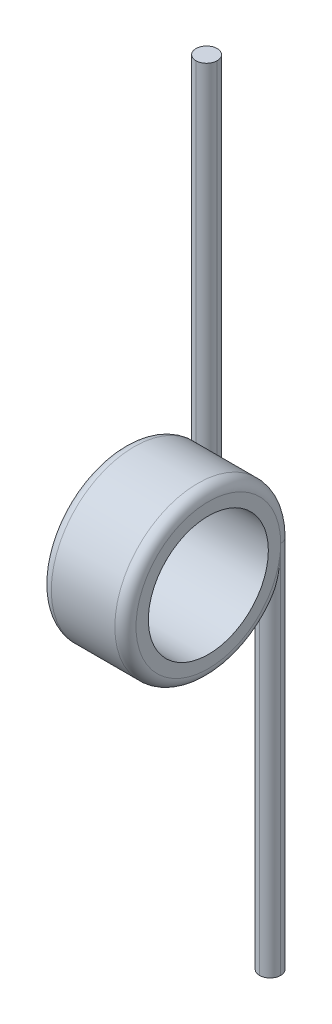
ISO-10303-21;
HEADER;
FILE_DESCRIPTION(('STEP AP214'),'2;1');
FILE_NAME('part.step','',(''),(''),'','','');
FILE_SCHEMA(('AUTOMOTIVE_DESIGN { 1 0 10303 214 1 1 1 1 }'));
ENDSEC;
DATA;
#1=APPLICATION_CONTEXT('core data for automotive mechanical design processes');
#2=APPLICATION_PROTOCOL_DEFINITION('international standard','automotive_design',2000,#1);
#3=PRODUCT_CONTEXT('',#1,'mechanical');
#4=PRODUCT('Part','Part','',(#3));
#5=PRODUCT_RELATED_PRODUCT_CATEGORY('part','',(#4));
#6=PRODUCT_DEFINITION_FORMATION('','',#4);
#7=PRODUCT_DEFINITION_CONTEXT('part definition',#1,'design');
#8=PRODUCT_DEFINITION('design','',#6,#7);
#9=PRODUCT_DEFINITION_SHAPE('','',#8);
#10=(LENGTH_UNIT() NAMED_UNIT(*) SI_UNIT(.MILLI.,.METRE.));
#11=(NAMED_UNIT(*) PLANE_ANGLE_UNIT() SI_UNIT($,.RADIAN.));
#12=(NAMED_UNIT(*) SI_UNIT($,.STERADIAN.) SOLID_ANGLE_UNIT());
#13=UNCERTAINTY_MEASURE_WITH_UNIT(LENGTH_MEASURE(1.E-05),#10,'distance_accuracy_value','');
#14=(GEOMETRIC_REPRESENTATION_CONTEXT(3) GLOBAL_UNCERTAINTY_ASSIGNED_CONTEXT((#13)) GLOBAL_UNIT_ASSIGNED_CONTEXT((#10,
#11,#12)) REPRESENTATION_CONTEXT('',''));
#15=CARTESIAN_POINT('',(0.,0.,0.));
#16=DIRECTION('',(0.,0.,1.));
#17=DIRECTION('',(1.,0.,0.));
#18=AXIS2_PLACEMENT_3D('',#15,#16,#17);
#19=CARTESIAN_POINT('',(2.4,-10.6015024974155,0.));
#20=DIRECTION('',(0.,1.,0.));
#21=DIRECTION('',(0.,0.,1.));
#22=AXIS2_PLACEMENT_3D('',#19,#20,#21);
#23=PLANE('',#22);
#24=CARTESIAN_POINT('',(2.1,-10.6015024974155,-2.05));
#25=DIRECTION('',(0.,1.,0.));
#26=DIRECTION('',(0.,0.,1.));
#27=AXIS2_PLACEMENT_3D('',#24,#25,#26);
#28=CIRCLE('',#27,0.3);
#29=CARTESIAN_POINT('',(1.8,-10.6015024974155,-2.05));
#30=VERTEX_POINT('',#29);
#31=CARTESIAN_POINT('',(2.1,-10.6015024974155,-2.35));
#32=VERTEX_POINT('',#31);
#33=EDGE_CURVE('E126',#30,#32,#28,.F.);
#34=ORIENTED_EDGE('',*,*,#33,.T.);
#35=CARTESIAN_POINT('',(2.1,-10.6015024974155,-2.05));
#36=DIRECTION('',(0.,1.,0.));
#37=DIRECTION('',(0.,0.,1.));
#38=AXIS2_PLACEMENT_3D('',#35,#36,#37);
#39=CIRCLE('',#38,0.3);
#40=CARTESIAN_POINT('',(2.4,-10.6015024974155,-2.05));
#41=VERTEX_POINT('',#40);
#42=EDGE_CURVE('E121',#32,#41,#39,.F.);
#43=ORIENTED_EDGE('',*,*,#42,.T.);
#44=CARTESIAN_POINT('',(2.1,-10.6015024974155,-2.05));
#45=DIRECTION('',(0.,1.,0.));
#46=DIRECTION('',(0.,0.,1.));
#47=AXIS2_PLACEMENT_3D('',#44,#45,#46);
#48=CIRCLE('',#47,0.3);
#49=CARTESIAN_POINT('',(2.1,-10.6015024974155,-1.75));
#50=VERTEX_POINT('',#49);
#51=EDGE_CURVE('E102',#41,#50,#48,.F.);
#52=ORIENTED_EDGE('',*,*,#51,.T.);
#53=CARTESIAN_POINT('',(2.1,-10.6015024974155,-2.05));
#54=DIRECTION('',(0.,1.,0.));
#55=DIRECTION('',(0.,0.,1.));
#56=AXIS2_PLACEMENT_3D('',#53,#54,#55);
#57=CIRCLE('',#56,0.3);
#58=EDGE_CURVE('E113',#50,#30,#57,.F.);
#59=ORIENTED_EDGE('',*,*,#58,.T.);
#60=EDGE_LOOP('',(#34,#43,#52,#59));
#61=FACE_BOUND('',#60,.T.);
#62=ADVANCED_FACE('F34',(#61),#23,.F.);
#63=CARTESIAN_POINT('',(0.,0.,0.));
#64=DIRECTION('',(1.,0.,0.));
#65=DIRECTION('',(0.,0.,-1.));
#66=AXIS2_PLACEMENT_3D('',#63,#64,#65);
#67=PLANE('',#66);
#68=CARTESIAN_POINT('',(0.,0.,0.));
#69=DIRECTION('',(1.,0.,0.));
#70=DIRECTION('',(0.,0.,-1.));
#71=AXIS2_PLACEMENT_3D('',#68,#69,#70);
#72=CIRCLE('',#71,2.05);
#73=CARTESIAN_POINT('',(0.,0.,-2.05));
#74=VERTEX_POINT('',#73);
#75=EDGE_CURVE('E114',#74,#74,#72,.F.);
#76=ORIENTED_EDGE('',*,*,#75,.T.);
#77=EDGE_LOOP('',(#76));
#78=FACE_BOUND('',#77,.T.);
#79=CARTESIAN_POINT('',(0.,0.,0.));
#80=DIRECTION('',(1.,0.,0.));
#81=DIRECTION('',(0.,0.,-1.));
#82=AXIS2_PLACEMENT_3D('',#79,#80,#81);
#83=CIRCLE('',#82,1.7);
#84=CARTESIAN_POINT('',(0.,0.,-1.7));
#85=VERTEX_POINT('',#84);
#86=EDGE_CURVE('E226',#85,#85,#83,.T.);
#87=ORIENTED_EDGE('',*,*,#86,.T.);
#88=EDGE_LOOP('',(#87));
#89=FACE_BOUND('',#88,.T.);
#90=ADVANCED_FACE('F252',(#78,#89),#67,.F.);
#91=CARTESIAN_POINT('',(2.4,10.9422582567093,0.));
#92=DIRECTION('',(0.,-1.,0.));
#93=DIRECTION('',(0.,0.,-1.));
#94=AXIS2_PLACEMENT_3D('',#91,#92,#93);
#95=PLANE('',#94);
#96=CARTESIAN_POINT('',(0.3,10.9422582567093,-2.05));
#97=DIRECTION('',(0.,-1.,0.));
#98=DIRECTION('',(0.,0.,-1.));
#99=AXIS2_PLACEMENT_3D('',#96,#97,#98);
#100=CIRCLE('',#99,0.3);
#101=CARTESIAN_POINT('',(0.,10.9422582567093,-2.05));
#102=VERTEX_POINT('',#101);
#103=CARTESIAN_POINT('',(0.3,10.9422582567093,-1.75));
#104=VERTEX_POINT('',#103);
#105=EDGE_CURVE('E136',#102,#104,#100,.F.);
#106=ORIENTED_EDGE('',*,*,#105,.T.);
#107=CARTESIAN_POINT('',(0.3,10.9422582567093,-2.05));
#108=DIRECTION('',(0.,-1.,0.));
#109=DIRECTION('',(0.,0.,-1.));
#110=AXIS2_PLACEMENT_3D('',#107,#108,#109);
#111=CIRCLE('',#110,0.3);
#112=CARTESIAN_POINT('',(0.6,10.9422582567093,-2.05));
#113=VERTEX_POINT('',#112);
#114=EDGE_CURVE('E138',#104,#113,#111,.F.);
#115=ORIENTED_EDGE('',*,*,#114,.T.);
#116=CARTESIAN_POINT('',(0.3,10.9422582567093,-2.05));
#117=DIRECTION('',(0.,-1.,0.));
#118=DIRECTION('',(0.,0.,-1.));
#119=AXIS2_PLACEMENT_3D('',#116,#117,#118);
#120=CIRCLE('',#119,0.3);
#121=CARTESIAN_POINT('',(0.3,10.9422582567093,-2.35));
#122=VERTEX_POINT('',#121);
#123=EDGE_CURVE('E128',#113,#122,#120,.F.);
#124=ORIENTED_EDGE('',*,*,#123,.T.);
#125=CARTESIAN_POINT('',(0.3,10.9422582567093,-2.05));
#126=DIRECTION('',(0.,-1.,0.));
#127=DIRECTION('',(0.,0.,-1.));
#128=AXIS2_PLACEMENT_3D('',#125,#126,#127);
#129=CIRCLE('',#128,0.3);
#130=EDGE_CURVE('E130',#122,#102,#129,.F.);
#131=ORIENTED_EDGE('',*,*,#130,.T.);
#132=EDGE_LOOP('',(#106,#115,#124,#131));
#133=FACE_BOUND('',#132,.T.);
#134=ADVANCED_FACE('F256',(#133),#95,.F.);
#135=CARTESIAN_POINT('',(2.4,0.,0.));
#136=DIRECTION('',(1.,0.,0.));
#137=DIRECTION('',(0.,0.,-1.));
#138=AXIS2_PLACEMENT_3D('',#135,#136,#137);
#139=PLANE('',#138);
#140=CARTESIAN_POINT('',(2.4,0.,0.));
#141=DIRECTION('',(1.,0.,0.));
#142=DIRECTION('',(0.,0.,-1.));
#143=AXIS2_PLACEMENT_3D('',#140,#141,#142);
#144=CIRCLE('',#143,2.05);
#145=CARTESIAN_POINT('',(2.4,0.,-2.05));
#146=VERTEX_POINT('',#145);
#147=EDGE_CURVE('E235',#146,#146,#144,.T.);
#148=ORIENTED_EDGE('',*,*,#147,.T.);
#149=EDGE_LOOP('',(#148));
#150=FACE_BOUND('',#149,.T.);
#151=CARTESIAN_POINT('',(2.4,0.,0.));
#152=DIRECTION('',(1.,0.,0.));
#153=DIRECTION('',(0.,0.,-1.));
#154=AXIS2_PLACEMENT_3D('',#151,#152,#153);
#155=CIRCLE('',#154,1.7);
#156=CARTESIAN_POINT('',(2.4,0.,-1.7));
#157=VERTEX_POINT('',#156);
#158=EDGE_CURVE('E230',#157,#157,#155,.T.);
#159=ORIENTED_EDGE('',*,*,#158,.F.);
#160=EDGE_LOOP('',(#159));
#161=FACE_BOUND('',#160,.T.);
#162=ADVANCED_FACE('F162',(#150,#161),#139,.T.);
#163=CARTESIAN_POINT('',(2.4,0.,0.));
#164=DIRECTION('',(-1.,0.,0.));
#165=DIRECTION('',(0.,0.,1.));
#166=AXIS2_PLACEMENT_3D('',#163,#164,#165);
#167=CYLINDRICAL_SURFACE('',#166,2.35);
#168=CARTESIAN_POINT('',(0.3,0.,0.));
#169=DIRECTION('',(1.,0.,0.));
#170=DIRECTION('',(0.,0.,-1.));
#171=AXIS2_PLACEMENT_3D('',#168,#169,#170);
#172=CIRCLE('',#171,2.35);
#173=CARTESIAN_POINT('',(0.3,1.56843871413581,-1.75));
#174=VERTEX_POINT('',#173);
#175=CARTESIAN_POINT('',(0.3,0.,-2.35));
#176=VERTEX_POINT('',#175);
#177=EDGE_CURVE('E239',#174,#176,#172,.T.);
#178=ORIENTED_EDGE('',*,*,#177,.T.);
#179=CARTESIAN_POINT('',(0.6,1.1489125293076,-2.05));
#180=CARTESIAN_POINT('',(0.599960897908316,1.11487720167346,-2.0690806456481));
#181=CARTESIAN_POINT('',(0.598184517185481,1.08041202674306,-2.08727710119757));
#182=CARTESIAN_POINT('',(0.59181572047832,1.01090270748885,-2.12180863309271));
#183=CARTESIAN_POINT('',(0.5872295453966,0.975860013295098,-2.13814773975569));
#184=CARTESIAN_POINT('',(0.575919927312587,0.905486892506885,-2.1688853257731));
#185=CARTESIAN_POINT('',(0.569206457929604,0.870158543636951,-2.18329242335187));
#186=CARTESIAN_POINT('',(0.554070752374232,0.799146199827539,-2.21027351721576));
#187=CARTESIAN_POINT('',(0.545647246373268,0.76346195944649,-2.22284613927265));
#188=CARTESIAN_POINT('',(0.521549887331211,0.668580291535564,-2.2537432383816));
#189=CARTESIAN_POINT('',(0.504719710754082,0.609160239332653,-2.27050173421432));
#190=CARTESIAN_POINT('',(0.468636287895128,0.489914990532907,-2.29918464934066));
#191=CARTESIAN_POINT('',(0.449381983151872,0.430089627825664,-2.31110694731725));
#192=CARTESIAN_POINT('',(0.389340904765782,0.250133117517262,-2.33980495302457));
#193=CARTESIAN_POINT('',(0.346273265647577,0.129512104308802,-2.34951479473851));
#194=CARTESIAN_POINT('',(0.302174677455335,0.00608657604286636,-2.34999408269409));
#195=CARTESIAN_POINT('',(0.30108729565015,0.00304320442613191,-2.3499999937176));
#196=CARTESIAN_POINT('',(0.3,0.,-2.35));
#197=B_SPLINE_CURVE_WITH_KNOTS('',3,(#179,#180,#181,#182,#183,#184,#185,#186,#187,#188,#189,
#190,#191,#192,#193,#194,#195,#196),.UNSPECIFIED.,.F.,.F.,(4,2,2,2,2,2,2,2,4),(0.,
0.116925728742581,0.233592687722627,0.349720562261108,0.465934987850017,0.657609228762929,
0.849367453688178,1.23285338460743,1.24254876054494),.UNSPECIFIED.);
#198=CARTESIAN_POINT('',(0.6,1.1489125293076,-2.05));
#199=VERTEX_POINT('',#198);
#200=EDGE_CURVE('E11',#176,#199,#197,.F.);
#201=ORIENTED_EDGE('',*,*,#200,.T.);
#202=CARTESIAN_POINT('',(0.6,1.1489125293076,-2.05));
#203=CARTESIAN_POINT('',(0.599987090965788,1.17090446938805,-2.03767950540431));
#204=CARTESIAN_POINT('',(0.599238776736917,1.19271761011913,-2.02498482386973));
#205=CARTESIAN_POINT('',(0.595911030860919,1.23596958021221,-1.99887880335964));
#206=CARTESIAN_POINT('',(0.593318985994564,1.25740478305764,-1.98546311963845));
#207=CARTESIAN_POINT('',(0.585876968664216,1.29990065540559,-1.95790968452263));
#208=CARTESIAN_POINT('',(0.580992815205782,1.32095046228926,-1.94376399159881));
#209=CARTESIAN_POINT('',(0.568478553713931,1.36198122987769,-1.91523556228604));
#210=CARTESIAN_POINT('',(0.560857317589097,1.38196540705528,-1.90085373339966));
#211=CARTESIAN_POINT('',(0.544850991428104,1.41513317650281,-1.87621956545622));
#212=CARTESIAN_POINT('',(0.537261762193021,1.42866759004314,-1.86592647891774));
#213=CARTESIAN_POINT('',(0.520093814646604,1.45469005877854,-1.84571044737516));
#214=CARTESIAN_POINT('',(0.510518760701589,1.46717998258745,-1.83578685978158));
#215=CARTESIAN_POINT('',(0.48899449525333,1.49091546586128,-1.81656462243822));
#216=CARTESIAN_POINT('',(0.477017065804432,1.5021434921791,-1.80727535013956));
#217=CARTESIAN_POINT('',(0.450605628432912,1.52260748337052,-1.79006832791638));
#218=CARTESIAN_POINT('',(0.436177410680047,1.53184802980875,-1.78214743207865));
#219=CARTESIAN_POINT('',(0.410235974108335,1.54498091953056,-1.77075772801538));
#220=CARTESIAN_POINT('',(0.39936783945375,1.54962758971286,-1.76668669789042));
#221=CARTESIAN_POINT('',(0.376775078751499,1.55749920722761,-1.75975103396648));
#222=CARTESIAN_POINT('',(0.365052338202297,1.5607271801682,-1.7568838333902));
#223=CARTESIAN_POINT('',(0.344418513431898,1.56488828974393,-1.75317721354713));
#224=CARTESIAN_POINT('',(0.335645848808884,1.56621175222782,-1.7519940722426));
#225=CARTESIAN_POINT('',(0.317918625058824,1.56799055386565,-1.7504016669283));
#226=CARTESIAN_POINT('',(0.308963612551943,1.56844336657812,-1.74999465511027));
#227=CARTESIAN_POINT('',(0.3,1.56843871413581,-1.75));
#228=B_SPLINE_CURVE_WITH_KNOTS('',3,(#202,#203,#204,#205,#206,#207,#208,#209,#210,#211,#212,
#213,#214,#215,#216,#217,#218,#219,#220,#221,#222,#223,#224,#225,#226,#227),.UNSPECIFIED.,.F.,
.F.,(4,2,2,2,2,2,2,2,2,2,2,2,4),(0.,0.0756512425351515,0.151825065987849,0.229172793045448,
0.306272037068627,0.36202247000163,0.417670929782647,0.474015961927186,0.530229680596288,
0.567591820004128,0.604873887132015,0.631651567524426,0.658506834502977),.UNSPECIFIED.);
#229=EDGE_CURVE('E44',#199,#174,#228,.T.);
#230=ORIENTED_EDGE('',*,*,#229,.T.);
#231=EDGE_LOOP('',(#178,#201,#230));
#232=FACE_BOUND('',#231,.T.);
#233=CARTESIAN_POINT('',(1.8,-1.1489125293076,-2.05));
#234=CARTESIAN_POINT('',(1.80003910209168,-1.11487720167346,-2.0690806456481));
#235=CARTESIAN_POINT('',(1.80181548281452,-1.08041202674306,-2.08727710119757));
#236=CARTESIAN_POINT('',(1.80818427952168,-1.01090270748885,-2.12180863309271));
#237=CARTESIAN_POINT('',(1.8127704546034,-0.975860013295097,-2.13814773975569));
#238=CARTESIAN_POINT('',(1.82408007268741,-0.905486892506884,-2.16888532577311));
#239=CARTESIAN_POINT('',(1.8307935420704,-0.87015854363695,-2.18329242335187));
#240=CARTESIAN_POINT('',(1.84592924762577,-0.799146199827539,-2.21027351721576));
#241=CARTESIAN_POINT('',(1.85435275362673,-0.76346195944649,-2.22284613927265));
#242=CARTESIAN_POINT('',(1.87845011266879,-0.668580291535564,-2.2537432383816));
#243=CARTESIAN_POINT('',(1.89528028924592,-0.609160239332653,-2.27050173421432));
#244=CARTESIAN_POINT('',(1.93136371210487,-0.489914990532907,-2.29918464934066));
#245=CARTESIAN_POINT('',(1.95061801684813,-0.430089627825664,-2.31110694731725));
#246=CARTESIAN_POINT('',(2.01065909523422,-0.250133117517263,-2.33980495302457));
#247=CARTESIAN_POINT('',(2.05372673435243,-0.129512104308803,-2.34951479473851));
#248=CARTESIAN_POINT('',(2.09782532254466,-0.00608657604286619,-2.34999408269409));
#249=CARTESIAN_POINT('',(2.09891270434985,-0.00304320442613183,-2.3499999937176));
#250=CARTESIAN_POINT('',(2.1,0.,-2.35));
#251=B_SPLINE_CURVE_WITH_KNOTS('',3,(#233,#234,#235,#236,#237,#238,#239,#240,#241,#242,#243,
#244,#245,#246,#247,#248,#249,#250),.UNSPECIFIED.,.F.,.F.,(4,2,2,2,2,2,2,2,4),(0.,
0.116925728742581,0.233592687722627,0.349720562261108,0.465934987850015,0.657609228762927,
0.849367453688177,1.23285338460743,1.24254876054494),.UNSPECIFIED.);
#252=CARTESIAN_POINT('',(2.1,0.,-2.35));
#253=VERTEX_POINT('',#252);
#254=CARTESIAN_POINT('',(1.8,-1.1489125293076,-2.05));
#255=VERTEX_POINT('',#254);
#256=EDGE_CURVE('E58',#253,#255,#251,.F.);
#257=ORIENTED_EDGE('',*,*,#256,.T.);
#258=CARTESIAN_POINT('',(1.8,-1.1489125293076,-2.05));
#259=CARTESIAN_POINT('',(1.80001290903421,-1.17090446938805,-2.03767950540432));
#260=CARTESIAN_POINT('',(1.80076122326308,-1.19271761011913,-2.02498482386973));
#261=CARTESIAN_POINT('',(1.80408896913908,-1.23596958021221,-1.99887880335964));
#262=CARTESIAN_POINT('',(1.80668101400544,-1.25740478305764,-1.98546311963845));
#263=CARTESIAN_POINT('',(1.81412303133578,-1.29990065540558,-1.95790968452263));
#264=CARTESIAN_POINT('',(1.81900718479422,-1.32095046228926,-1.94376399159881));
#265=CARTESIAN_POINT('',(1.83152144628607,-1.36198122987769,-1.91523556228604));
#266=CARTESIAN_POINT('',(1.8391426824109,-1.38196540705528,-1.90085373339966));
#267=CARTESIAN_POINT('',(1.8551490085719,-1.41513317650281,-1.87621956545622));
#268=CARTESIAN_POINT('',(1.86273823780698,-1.42866759004314,-1.86592647891774));
#269=CARTESIAN_POINT('',(1.87990618535339,-1.45469005877853,-1.84571044737516));
#270=CARTESIAN_POINT('',(1.88948123929841,-1.46717998258745,-1.83578685978158));
#271=CARTESIAN_POINT('',(1.91100550474667,-1.49091546586128,-1.81656462243822));
#272=CARTESIAN_POINT('',(1.92298293419557,-1.5021434921791,-1.80727535013957));
#273=CARTESIAN_POINT('',(1.94939437156709,-1.52260748337052,-1.79006832791638));
#274=CARTESIAN_POINT('',(1.96382258931995,-1.53184802980875,-1.78214743207865));
#275=CARTESIAN_POINT('',(1.98976402589166,-1.54498091953056,-1.77075772801538));
#276=CARTESIAN_POINT('',(2.00063216054625,-1.54962758971286,-1.76668669789042));
#277=CARTESIAN_POINT('',(2.0232249212485,-1.55749920722761,-1.75975103396648));
#278=CARTESIAN_POINT('',(2.0349476617977,-1.5607271801682,-1.7568838333902));
#279=CARTESIAN_POINT('',(2.0555814865681,-1.56488828974393,-1.75317721354714));
#280=CARTESIAN_POINT('',(2.06435415119111,-1.56621175222782,-1.7519940722426));
#281=CARTESIAN_POINT('',(2.08208137494117,-1.56799055386565,-1.7504016669283));
#282=CARTESIAN_POINT('',(2.09103638744806,-1.56844336657812,-1.74999465511027));
#283=CARTESIAN_POINT('',(2.1,-1.56843871413581,-1.75));
#284=B_SPLINE_CURVE_WITH_KNOTS('',3,(#258,#259,#260,#261,#262,#263,#264,#265,#266,#267,#268,
#269,#270,#271,#272,#273,#274,#275,#276,#277,#278,#279,#280,#281,#282,#283),.UNSPECIFIED.,.F.,
.F.,(4,2,2,2,2,2,2,2,2,2,2,2,4),(0.,0.0756512425351516,0.151825065987848,0.229172793045448,
0.306272037068626,0.36202247000163,0.417670929782646,0.474015961927184,0.530229680596287,
0.567591820004126,0.604873887132013,0.631651567524425,0.658506834502978),.UNSPECIFIED.);
#285=CARTESIAN_POINT('',(2.1,-1.56843871413581,-1.75));
#286=VERTEX_POINT('',#285);
#287=EDGE_CURVE('E147',#255,#286,#284,.T.);
#288=ORIENTED_EDGE('',*,*,#287,.T.);
#289=CARTESIAN_POINT('',(2.1,0.,0.));
#290=DIRECTION('',(1.,0.,0.));
#291=DIRECTION('',(0.,0.,-1.));
#292=AXIS2_PLACEMENT_3D('',#289,#290,#291);
#293=CIRCLE('',#292,2.35);
#294=EDGE_CURVE('E241',#286,#253,#293,.F.);
#295=ORIENTED_EDGE('',*,*,#294,.T.);
#296=EDGE_LOOP('',(#257,#288,#295));
#297=FACE_BOUND('',#296,.T.);
#298=ADVANCED_FACE('F156',(#232,#297),#167,.T.);
#299=CARTESIAN_POINT('',(2.4,0.,0.));
#300=DIRECTION('',(-1.,0.,0.));
#301=DIRECTION('',(0.,0.,1.));
#302=AXIS2_PLACEMENT_3D('',#299,#300,#301);
#303=CYLINDRICAL_SURFACE('',#302,1.7);
#304=ORIENTED_EDGE('',*,*,#158,.T.);
#305=EDGE_LOOP('',(#304));
#306=FACE_BOUND('',#305,.T.);
#307=ORIENTED_EDGE('',*,*,#86,.F.);
#308=EDGE_LOOP('',(#307));
#309=FACE_BOUND('',#308,.T.);
#310=ADVANCED_FACE('F161',(#306,#309),#303,.F.);
#311=CARTESIAN_POINT('',(2.1,0.,-2.05));
#312=DIRECTION('',(0.,1.,0.));
#313=DIRECTION('',(0.,0.,1.));
#314=AXIS2_PLACEMENT_3D('',#311,#312,#313);
#315=CYLINDRICAL_SURFACE('',#314,0.3);
#316=DIRECTION('',(0.,-1.,0.));
#317=VECTOR('',#316,1.);
#318=CARTESIAN_POINT('',(2.1,0.,-2.35));
#319=LINE('',#318,#317);
#320=EDGE_CURVE('E123',#32,#253,#319,.F.);
#321=ORIENTED_EDGE('',*,*,#320,.F.);
#322=ORIENTED_EDGE('',*,*,#33,.F.);
#323=DIRECTION('',(0.,-1.,0.));
#324=VECTOR('',#323,1.);
#325=CARTESIAN_POINT('',(1.8,-10.6015024974155,-2.05));
#326=LINE('',#325,#324);
#327=EDGE_CURVE('E224',#255,#30,#326,.T.);
#328=ORIENTED_EDGE('',*,*,#327,.F.);
#329=ORIENTED_EDGE('',*,*,#256,.F.);
#330=EDGE_LOOP('',(#321,#322,#328,#329));
#331=FACE_BOUND('',#330,.T.);
#332=ADVANCED_FACE('F153',(#331),#315,.T.);
#333=CARTESIAN_POINT('',(2.1,0.,-2.05));
#334=DIRECTION('',(0.,-1.,0.));
#335=DIRECTION('',(0.,0.,-1.));
#336=AXIS2_PLACEMENT_3D('',#333,#334,#335);
#337=CYLINDRICAL_SURFACE('',#336,0.3);
#338=ORIENTED_EDGE('',*,*,#327,.T.);
#339=ORIENTED_EDGE('',*,*,#58,.F.);
#340=DIRECTION('',(0.,1.,0.));
#341=VECTOR('',#340,1.);
#342=CARTESIAN_POINT('',(2.1,-10.6015024974155,-1.75));
#343=LINE('',#342,#341);
#344=EDGE_CURVE('E109',#286,#50,#343,.F.);
#345=ORIENTED_EDGE('',*,*,#344,.F.);
#346=ORIENTED_EDGE('',*,*,#287,.F.);
#347=EDGE_LOOP('',(#338,#339,#345,#346));
#348=FACE_BOUND('',#347,.T.);
#349=ADVANCED_FACE('F270',(#348),#337,.T.);
#350=CARTESIAN_POINT('',(2.1,0.,-2.05));
#351=DIRECTION('',(0.,-1.,0.));
#352=DIRECTION('',(0.,0.,-1.));
#353=AXIS2_PLACEMENT_3D('',#350,#351,#352);
#354=CYLINDRICAL_SURFACE('',#353,0.3);
#355=DIRECTION('',(0.,1.,0.));
#356=VECTOR('',#355,1.);
#357=CARTESIAN_POINT('',(2.4,0.,-2.05));
#358=LINE('',#357,#356);
#359=EDGE_CURVE('E106',#41,#146,#358,.T.);
#360=ORIENTED_EDGE('',*,*,#359,.F.);
#361=ORIENTED_EDGE('',*,*,#42,.F.);
#362=ORIENTED_EDGE('',*,*,#320,.T.);
#363=CARTESIAN_POINT('',(2.1,0.,-2.05));
#364=DIRECTION('',(0.,1.,0.));
#365=DIRECTION('',(0.,0.,1.));
#366=AXIS2_PLACEMENT_3D('',#363,#364,#365);
#367=CIRCLE('',#366,0.3);
#368=EDGE_CURVE('E122',#146,#253,#367,.T.);
#369=ORIENTED_EDGE('',*,*,#368,.F.);
#370=EDGE_LOOP('',(#360,#361,#362,#369));
#371=FACE_BOUND('',#370,.T.);
#372=ADVANCED_FACE('F119',(#371),#354,.T.);
#373=CARTESIAN_POINT('',(2.1,0.,-2.05));
#374=DIRECTION('',(0.,1.,0.));
#375=DIRECTION('',(0.,0.,1.));
#376=AXIS2_PLACEMENT_3D('',#373,#374,#375);
#377=CYLINDRICAL_SURFACE('',#376,0.3);
#378=ORIENTED_EDGE('',*,*,#51,.F.);
#379=ORIENTED_EDGE('',*,*,#359,.T.);
#380=CARTESIAN_POINT('',(2.4,-7.14293904254122E-07,-2.05000000000025));
#381=CARTESIAN_POINT('',(2.39999938270146,-0.0213449964952088,-2.05000006690265));
#382=CARTESIAN_POINT('',(2.39999997588628,-0.0426894509598533,-2.0498333223045));
#383=CARTESIAN_POINT('',(2.39999927268456,-0.0809201521372277,-2.04923622409633));
#384=CARTESIAN_POINT('',(2.39999834472649,-0.09780739418896,-2.04886813040533));
#385=CARTESIAN_POINT('',(2.39999344219287,-0.129237032681055,-2.04798895890219));
#386=CARTESIAN_POINT('',(2.39998990742161,-0.143780221427801,-2.04750474877433));
#387=CARTESIAN_POINT('',(2.39996249835543,-0.21649587626807,-2.04469668541978));
#388=CARTESIAN_POINT('',(2.39990941916889,-0.274630537625909,-2.04121269631643));
#389=CARTESIAN_POINT('',(2.39959134903788,-0.361237156335402,-2.034185981542));
#390=CARTESIAN_POINT('',(2.39944758077566,-0.389789263128084,-2.03157047696874));
#391=CARTESIAN_POINT('',(2.39903238436709,-0.446859239650612,-2.02574777598513));
#392=CARTESIAN_POINT('',(2.39876083778877,-0.475377052959975,-2.0225400323345));
#393=CARTESIAN_POINT('',(2.39766694664965,-0.561283801946342,-2.01198260032399));
#394=CARTESIAN_POINT('',(2.39656529713882,-0.618562094089737,-2.00373640076081));
#395=CARTESIAN_POINT('',(2.39301459912658,-0.732696104776577,-1.98492831323475));
#396=CARTESIAN_POINT('',(2.39056563791809,-0.789551850455145,-1.97436657532329));
#397=CARTESIAN_POINT('',(2.383473937261,-0.902526858733435,-1.95105230624978));
#398=CARTESIAN_POINT('',(2.37883687083479,-0.95864764235678,-1.9383054943539));
#399=CARTESIAN_POINT('',(2.36616969094188,-1.06997664011135,-1.91076057543637));
#400=CARTESIAN_POINT('',(2.35814367212726,-1.12518587223956,-1.89596495830424));
#401=CARTESIAN_POINT('',(2.34269591252038,-1.20340478436718,-1.87346167988679));
#402=CARTESIAN_POINT('',(2.33747634212335,-1.22704895350648,-1.86645141258569));
#403=CARTESIAN_POINT('',(2.32569294619983,-1.27397832421926,-1.85213776747202));
#404=CARTESIAN_POINT('',(2.31912623405345,-1.29726263753263,-1.84483378778024));
#405=CARTESIAN_POINT('',(2.3032228500663,-1.34645641157913,-1.82899305584059));
#406=CARTESIAN_POINT('',(2.29362628088549,-1.37227359194278,-1.82042759045439));
#407=CARTESIAN_POINT('',(2.27130025411781,-1.42249835721408,-1.80330715527479));
#408=CARTESIAN_POINT('',(2.25858440711453,-1.44691151188126,-1.79475229797503));
#409=CARTESIAN_POINT('',(2.2377896100356,-1.47846796001039,-1.7834400502236));
#410=CARTESIAN_POINT('',(2.23178262360164,-1.48686511941872,-1.78040224401638));
#411=CARTESIAN_POINT('',(2.2189253083422,-1.50308694705072,-1.77448718517317));
#412=CARTESIAN_POINT('',(2.21207353354871,-1.51091059610209,-1.7716102204192));
#413=CARTESIAN_POINT('',(2.19729097898175,-1.52578242585988,-1.76610291971471));
#414=CARTESIAN_POINT('',(2.18934832231442,-1.53282026322045,-1.76347592846736));
#415=CARTESIAN_POINT('',(2.1722954438922,-1.54552051429738,-1.75870809950524));
#416=CARTESIAN_POINT('',(2.16318960600463,-1.55118787230556,-1.75656551606546));
#417=CARTESIAN_POINT('',(2.14759844606465,-1.55863641350561,-1.75373911132837));
#418=CARTESIAN_POINT('',(2.14147143417985,-1.5610717534449,-1.75281203946601));
#419=CARTESIAN_POINT('',(2.12887763665173,-1.56496883328308,-1.75132639070553));
#420=CARTESIAN_POINT('',(2.12241185646334,-1.56643329569635,-1.75076678341333));
#421=CARTESIAN_POINT('',(2.11323962686514,-1.56770495876974,-1.75028064227783));
#422=CARTESIAN_POINT('',(2.11060153485319,-1.56797940210065,-1.7501756876081));
#423=CARTESIAN_POINT('',(2.10530941487483,-1.56834640397387,-1.75003531476421));
#424=CARTESIAN_POINT('',(2.10265537872682,-1.56843885938328,-1.74999993601887));
#425=CARTESIAN_POINT('',(2.10000000000001,-1.56843871413589,-1.74999999999999));
#426=B_SPLINE_CURVE_WITH_KNOTS('',3,(#380,#381,#382,#383,#384,#385,#386,#387,#388,#389,#390,
#391,#392,#393,#394,#395,#396,#397,#398,#399,#400,#401,#402,#403,#404,#405,#406,#407,#408,#409,
#410,#411,#412,#413,#414,#415,#416,#417,#418,#419,#420,#421,#422,#423,#424,#425),.UNSPECIFIED.,
.F.,.F.,(4,2,2,2,2,2,2,2,2,2,2,2,2,2,2,2,2,2,2,2,2,2,4),(0.,0.0640324802458228,
0.114704832897195,0.158358336883626,0.333009300482411,0.419020570488112,0.505111717973626,
0.678689291542519,0.852255620266835,1.02537440169118,1.19828461072094,1.27387959937954,
1.34963829539294,1.43606955522014,1.5221301895653,1.55438079181148,1.58668738223475,
1.61937866851006,1.65195019312877,1.67185295390624,1.69169966501448,1.69965686145868,
1.70761856596474),.UNSPECIFIED.);
#427=EDGE_CURVE('E177',#286,#146,#426,.F.);
#428=ORIENTED_EDGE('',*,*,#427,.F.);
#429=ORIENTED_EDGE('',*,*,#344,.T.);
#430=EDGE_LOOP('',(#378,#379,#428,#429));
#431=FACE_BOUND('',#430,.T.);
#432=ADVANCED_FACE('F104',(#431),#377,.T.);
#433=CARTESIAN_POINT('',(2.1,0.,0.));
#434=DIRECTION('',(1.,0.,0.));
#435=DIRECTION('',(0.,0.,-1.));
#436=AXIS2_PLACEMENT_3D('',#433,#434,#435);
#437=TOROIDAL_SURFACE('',#436,2.05,0.3);
#438=ORIENTED_EDGE('',*,*,#368,.T.);
#439=ORIENTED_EDGE('',*,*,#294,.F.);
#440=ORIENTED_EDGE('',*,*,#427,.T.);
#441=ORIENTED_EDGE('',*,*,#147,.F.);
#442=EDGE_LOOP('',(#438,#439,#440,#441));
#443=FACE_BOUND('',#442,.T.);
#444=ADVANCED_FACE('F164',(#443),#437,.T.);
#445=CARTESIAN_POINT('',(0.3,0.,-2.05));
#446=DIRECTION('',(0.,-1.,0.));
#447=DIRECTION('',(0.,0.,-1.));
#448=AXIS2_PLACEMENT_3D('',#445,#446,#447);
#449=CYLINDRICAL_SURFACE('',#448,0.3);
#450=DIRECTION('',(0.,-1.,0.));
#451=VECTOR('',#450,1.);
#452=CARTESIAN_POINT('',(0.3,0.,-1.75));
#453=LINE('',#452,#451);
#454=EDGE_CURVE('E212',#174,#104,#453,.F.);
#455=ORIENTED_EDGE('',*,*,#454,.F.);
#456=ORIENTED_EDGE('',*,*,#229,.F.);
#457=DIRECTION('',(0.,-1.,0.));
#458=VECTOR('',#457,1.);
#459=CARTESIAN_POINT('',(0.6,0.,-2.05));
#460=LINE('',#459,#458);
#461=EDGE_CURVE('E39',#113,#199,#460,.T.);
#462=ORIENTED_EDGE('',*,*,#461,.F.);
#463=ORIENTED_EDGE('',*,*,#114,.F.);
#464=EDGE_LOOP('',(#455,#456,#462,#463));
#465=FACE_BOUND('',#464,.T.);
#466=ADVANCED_FACE('F36',(#465),#449,.T.);
#467=CARTESIAN_POINT('',(0.3,0.,-2.05));
#468=DIRECTION('',(0.,-1.,0.));
#469=DIRECTION('',(0.,0.,-1.));
#470=AXIS2_PLACEMENT_3D('',#467,#468,#469);
#471=CYLINDRICAL_SURFACE('',#470,0.3);
#472=ORIENTED_EDGE('',*,*,#461,.T.);
#473=ORIENTED_EDGE('',*,*,#200,.F.);
#474=DIRECTION('',(0.,1.,0.));
#475=VECTOR('',#474,1.);
#476=CARTESIAN_POINT('',(0.3,0.,-2.35));
#477=LINE('',#476,#475);
#478=EDGE_CURVE('E210',#122,#176,#477,.F.);
#479=ORIENTED_EDGE('',*,*,#478,.F.);
#480=ORIENTED_EDGE('',*,*,#123,.F.);
#481=EDGE_LOOP('',(#472,#473,#479,#480));
#482=FACE_BOUND('',#481,.T.);
#483=ADVANCED_FACE('F182',(#482),#471,.T.);
#484=CARTESIAN_POINT('',(0.3,0.,-2.05));
#485=DIRECTION('',(0.,-1.,0.));
#486=DIRECTION('',(0.,0.,-1.));
#487=AXIS2_PLACEMENT_3D('',#484,#485,#486);
#488=CYLINDRICAL_SURFACE('',#487,0.3);
#489=ORIENTED_EDGE('',*,*,#454,.T.);
#490=ORIENTED_EDGE('',*,*,#105,.F.);
#491=DIRECTION('',(0.,1.,0.));
#492=VECTOR('',#491,1.);
#493=CARTESIAN_POINT('',(0.,10.9422582567093,-2.05));
#494=LINE('',#493,#492);
#495=EDGE_CURVE('E205',#74,#102,#494,.T.);
#496=ORIENTED_EDGE('',*,*,#495,.F.);
#497=CARTESIAN_POINT('',(0.,0.,-2.05));
#498=CARTESIAN_POINT('',(6.17318378516075E-07,0.0213445203015719,-2.05000007062335));
#499=CARTESIAN_POINT('',(2.41109138750189E-08,0.042689212894221,-2.04983332602286));
#500=CARTESIAN_POINT('',(7.27314198346913E-07,0.0809201521382858,-2.04923622409623));
#501=CARTESIAN_POINT('',(1.65527318967077E-06,0.0978073941892224,-2.04886813040531));
#502=CARTESIAN_POINT('',(6.5578074120776E-06,0.129237032680785,-2.04798895890221));
#503=CARTESIAN_POINT('',(1.0092578500894E-05,0.143780221427663,-2.04750474877434));
#504=CARTESIAN_POINT('',(3.75016441165842E-05,0.216495876268369,-2.04469668541974));
#505=CARTESIAN_POINT('',(9.05808310306242E-05,0.274630537625852,-2.04121269631643));
#506=CARTESIAN_POINT('',(0.000408650962154436,0.361237156335149,-2.03418598154202));
#507=CARTESIAN_POINT('',(0.000552419224352924,0.389789263127804,-2.03157047696877));
#508=CARTESIAN_POINT('',(0.000967615632895324,0.446859239650308,-2.02574777598517));
#509=CARTESIAN_POINT('',(0.00123916221121857,0.475377052959674,-2.02254003233454));
#510=CARTESIAN_POINT('',(0.00233305335035722,0.561283801946011,-2.01198260032404));
#511=CARTESIAN_POINT('',(0.00343470286117792,0.618562094089381,-2.00373640076086));
#512=CARTESIAN_POINT('',(0.00698540087340653,0.732696104776173,-1.98492831323482));
#513=CARTESIAN_POINT('',(0.00943436208188583,0.789551850454717,-1.97436657532337));
#514=CARTESIAN_POINT('',(0.0165260627389653,0.902526858732923,-1.95105230624989));
#515=CARTESIAN_POINT('',(0.0211631291651553,0.95864764235621,-1.93830549435403));
#516=CARTESIAN_POINT('',(0.0338303090580247,1.06997664011066,-1.91076057543655));
#517=CARTESIAN_POINT('',(0.04185632787262,1.12518587223883,-1.89596495830444));
#518=CARTESIAN_POINT('',(0.0573040874794606,1.20340478436643,-1.87346167988701));
#519=CARTESIAN_POINT('',(0.0625236578764886,1.22704895350577,-1.86645141258591));
#520=CARTESIAN_POINT('',(0.0743070537999977,1.27397832421863,-1.85213776747222));
#521=CARTESIAN_POINT('',(0.0808737659463721,1.29726263753205,-1.84483378778042));
#522=CARTESIAN_POINT('',(0.0967771499335254,1.34645641157862,-1.82899305584076));
#523=CARTESIAN_POINT('',(0.106373719114332,1.37227359194232,-1.82042759045454));
#524=CARTESIAN_POINT('',(0.128699745882003,1.42249835721371,-1.80330715527492));
#525=CARTESIAN_POINT('',(0.141415592885282,1.44691151188093,-1.79475229797515));
#526=CARTESIAN_POINT('',(0.162210389964213,1.47846796001013,-1.7834400502237));
#527=CARTESIAN_POINT('',(0.168217376398179,1.48686511941847,-1.78040224401647));
#528=CARTESIAN_POINT('',(0.181074691657616,1.5030869470505,-1.77448718517325));
#529=CARTESIAN_POINT('',(0.187926466451108,1.51091059610189,-1.77161022041927));
#530=CARTESIAN_POINT('',(0.202709021018065,1.52578242585971,-1.76610291971478));
#531=CARTESIAN_POINT('',(0.210651677685402,1.5328202632203,-1.76347592846742));
#532=CARTESIAN_POINT('',(0.227704556107621,1.54552051429727,-1.75870809950529));
#533=CARTESIAN_POINT('',(0.2368103939952,1.55118787230546,-1.7565655160655));
#534=CARTESIAN_POINT('',(0.252401553935184,1.55863641350554,-1.75373911132839));
#535=CARTESIAN_POINT('',(0.258528565819979,1.56107175344483,-1.75281203946603));
#536=CARTESIAN_POINT('',(0.271122363348106,1.56496883328304,-1.75132639070554));
#537=CARTESIAN_POINT('',(0.277588143536489,1.56643329569631,-1.75076678341335));
#538=CARTESIAN_POINT('',(0.286760373134723,1.56770495876973,-1.75028064227783));
#539=CARTESIAN_POINT('',(0.289398465146702,1.56797940210064,-1.7501756876081));
#540=CARTESIAN_POINT('',(0.294690585125115,1.56834640397387,-1.75003531476421));
#541=CARTESIAN_POINT('',(0.297344621273149,1.56843885938328,-1.74999993601887));
#542=CARTESIAN_POINT('',(0.299999999999989,1.56843871413589,-1.74999999999999));
#543=B_SPLINE_CURVE_WITH_KNOTS('',3,(#497,#498,#499,#500,#501,#502,#503,#504,#505,#506,#507,
#508,#509,#510,#511,#512,#513,#514,#515,#516,#517,#518,#519,#520,#521,#522,#523,#524,#525,#526,
#527,#528,#529,#530,#531,#532,#533,#534,#535,#536,#537,#538,#539,#540,#541,#542),.UNSPECIFIED.,
.F.,.F.,(4,2,2,2,2,2,2,2,2,2,2,2,2,2,2,2,2,2,2,2,2,2,4),(0.,0.0640331945179484,0.1147055471693,
0.158359051155702,0.33301001475437,0.419021284759915,0.505112432245455,0.678690005814259,
0.852256334538499,1.02537511596265,1.19828532499223,1.27388031365095,1.34963900966447,
1.4360702694918,1.52213090383708,1.5543815060833,1.58668809650661,1.61937938278196,
1.65195090740071,1.67185366817819,1.69170037928644,1.69965757573072,1.70761928023687),.UNSPECIFIED.);
#544=EDGE_CURVE('E198',#174,#74,#543,.F.);
#545=ORIENTED_EDGE('',*,*,#544,.F.);
#546=EDGE_LOOP('',(#489,#490,#496,#545));
#547=FACE_BOUND('',#546,.T.);
#548=ADVANCED_FACE('F186',(#547),#488,.T.);
#549=CARTESIAN_POINT('',(0.3,0.,-2.05));
#550=DIRECTION('',(0.,1.,0.));
#551=DIRECTION('',(0.,0.,1.));
#552=AXIS2_PLACEMENT_3D('',#549,#550,#551);
#553=CYLINDRICAL_SURFACE('',#552,0.3);
#554=ORIENTED_EDGE('',*,*,#130,.F.);
#555=ORIENTED_EDGE('',*,*,#478,.T.);
#556=CARTESIAN_POINT('',(0.3,0.,-2.05));
#557=DIRECTION('',(0.,-1.,0.));
#558=DIRECTION('',(0.,0.,-1.));
#559=AXIS2_PLACEMENT_3D('',#556,#557,#558);
#560=CIRCLE('',#559,0.3);
#561=EDGE_CURVE('E206',#74,#176,#560,.T.);
#562=ORIENTED_EDGE('',*,*,#561,.F.);
#563=ORIENTED_EDGE('',*,*,#495,.T.);
#564=EDGE_LOOP('',(#554,#555,#562,#563));
#565=FACE_BOUND('',#564,.T.);
#566=ADVANCED_FACE('F188',(#565),#553,.T.);
#567=CARTESIAN_POINT('',(0.3,0.,0.));
#568=DIRECTION('',(1.,0.,0.));
#569=DIRECTION('',(0.,0.,-1.));
#570=AXIS2_PLACEMENT_3D('',#567,#568,#569);
#571=TOROIDAL_SURFACE('',#570,2.05,0.3);
#572=ORIENTED_EDGE('',*,*,#544,.T.);
#573=ORIENTED_EDGE('',*,*,#75,.F.);
#574=ORIENTED_EDGE('',*,*,#561,.T.);
#575=ORIENTED_EDGE('',*,*,#177,.F.);
#576=EDGE_LOOP('',(#572,#573,#574,#575));
#577=FACE_BOUND('',#576,.T.);
#578=ADVANCED_FACE('F191',(#577),#571,.T.);
#579=CLOSED_SHELL('',(#62,#90,#134,#162,#298,#310,#332,#349,#372,#432,#444,#466,#483,#548,#566,#578));
#580=MANIFOLD_SOLID_BREP('B2',#579);
#581=ADVANCED_BREP_SHAPE_REPRESENTATION('',(#18,#580),#14);
#582=SHAPE_DEFINITION_REPRESENTATION(#9,#581);
ENDSEC;
END-ISO-10303-21;
